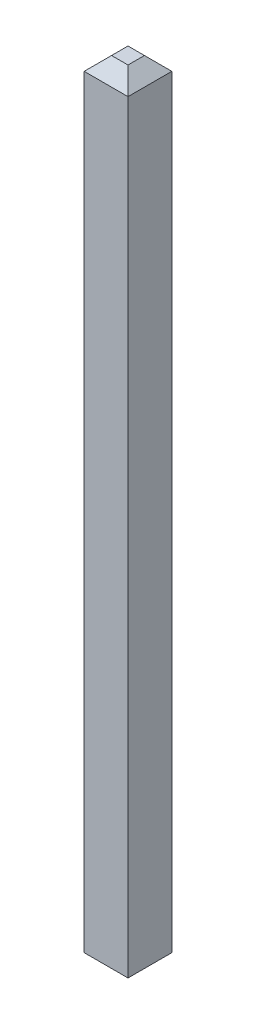
ISO-10303-21;
HEADER;
FILE_DESCRIPTION(('STEP AP214'),'2;1');
FILE_NAME('part.step','',(''),(''),'','','');
FILE_SCHEMA(('AUTOMOTIVE_DESIGN { 1 0 10303 214 1 1 1 1 }'));
ENDSEC;
DATA;
#1=APPLICATION_CONTEXT('core data for automotive mechanical design processes');
#2=APPLICATION_PROTOCOL_DEFINITION('international standard','automotive_design',2000,#1);
#3=PRODUCT_CONTEXT('',#1,'mechanical');
#4=PRODUCT('Part','Part','',(#3));
#5=PRODUCT_RELATED_PRODUCT_CATEGORY('part','',(#4));
#6=PRODUCT_DEFINITION_FORMATION('','',#4);
#7=PRODUCT_DEFINITION_CONTEXT('part definition',#1,'design');
#8=PRODUCT_DEFINITION('design','',#6,#7);
#9=PRODUCT_DEFINITION_SHAPE('','',#8);
#10=(LENGTH_UNIT() NAMED_UNIT(*) SI_UNIT(.MILLI.,.METRE.));
#11=(NAMED_UNIT(*) PLANE_ANGLE_UNIT() SI_UNIT($,.RADIAN.));
#12=(NAMED_UNIT(*) SI_UNIT($,.STERADIAN.) SOLID_ANGLE_UNIT());
#13=UNCERTAINTY_MEASURE_WITH_UNIT(LENGTH_MEASURE(1.E-05),#10,'distance_accuracy_value','');
#14=(GEOMETRIC_REPRESENTATION_CONTEXT(3) GLOBAL_UNCERTAINTY_ASSIGNED_CONTEXT((#13)) GLOBAL_UNIT_ASSIGNED_CONTEXT((#10,
#11,#12)) REPRESENTATION_CONTEXT('',''));
#15=CARTESIAN_POINT('',(0.,0.,0.));
#16=DIRECTION('',(0.,0.,1.));
#17=DIRECTION('',(1.,0.,0.));
#18=AXIS2_PLACEMENT_3D('',#15,#16,#17);
#19=CARTESIAN_POINT('',(9.21,7.07,-0.32));
#20=DIRECTION('',(-0.707106781186548,-0.707106781186548,0.));
#21=DIRECTION('',(-0.707106781186548,0.707106781186548,0.));
#22=AXIS2_PLACEMENT_3D('',#19,#20,#21);
#23=PLANE('',#22);
#24=DIRECTION('',(0.577350269189626,-0.577350269189626,0.577350269189626));
#25=VECTOR('',#24,1.);
#26=CARTESIAN_POINT('',(8.996666666667,7.283333333333,0.106666666667));
#27=LINE('',#26,#25);
#28=CARTESIAN_POINT('',(9.01,7.27,0.12));
#29=VERTEX_POINT('',#28);
#30=CARTESIAN_POINT('',(9.21,7.07,0.32));
#31=VERTEX_POINT('',#30);
#32=EDGE_CURVE('E113',#29,#31,#27,.T.);
#33=ORIENTED_EDGE('',*,*,#32,.T.);
#34=DIRECTION('',(0.,0.,1.));
#35=VECTOR('',#34,1.);
#36=CARTESIAN_POINT('',(9.21,7.07,-0.32));
#37=LINE('',#36,#35);
#38=CARTESIAN_POINT('',(9.21,7.07,-0.32));
#39=VERTEX_POINT('',#38);
#40=EDGE_CURVE('E111',#39,#31,#37,.T.);
#41=ORIENTED_EDGE('',*,*,#40,.F.);
#42=DIRECTION('',(0.577350269189626,-0.577350269189626,-0.577350269189626));
#43=VECTOR('',#42,1.);
#44=CARTESIAN_POINT('',(9.21,7.07,-0.32));
#45=LINE('',#44,#43);
#46=CARTESIAN_POINT('',(9.01,7.27,-0.12));
#47=VERTEX_POINT('',#46);
#48=EDGE_CURVE('E11',#47,#39,#45,.T.);
#49=ORIENTED_EDGE('',*,*,#48,.F.);
#50=DIRECTION('',(0.,0.,-1.));
#51=VECTOR('',#50,1.);
#52=CARTESIAN_POINT('',(9.01,7.27,-0.32));
#53=LINE('',#52,#51);
#54=EDGE_CURVE('E117',#29,#47,#53,.T.);
#55=ORIENTED_EDGE('',*,*,#54,.F.);
#56=EDGE_LOOP('',(#33,#41,#49,#55));
#57=FACE_BOUND('',#56,.T.);
#58=ADVANCED_FACE('F17',(#57),#23,.F.);
#59=CARTESIAN_POINT('',(8.89,7.07,-0.32));
#60=DIRECTION('',(0.,0.707106781186548,-0.707106781186548));
#61=DIRECTION('',(-1.,0.,0.));
#62=AXIS2_PLACEMENT_3D('',#59,#60,#61);
#63=PLANE('',#62);
#64=DIRECTION('',(0.577350269189626,0.577350269189626,0.577350269189626));
#65=VECTOR('',#64,1.);
#66=CARTESIAN_POINT('',(8.703333333333,7.203333333333,-0.186666666667));
#67=LINE('',#66,#65);
#68=CARTESIAN_POINT('',(8.57,7.07,-0.32));
#69=VERTEX_POINT('',#68);
#70=CARTESIAN_POINT('',(8.77,7.27,-0.12));
#71=VERTEX_POINT('',#70);
#72=EDGE_CURVE('E25',#69,#71,#67,.T.);
#73=ORIENTED_EDGE('',*,*,#72,.T.);
#74=DIRECTION('',(-1.,0.,0.));
#75=VECTOR('',#74,1.);
#76=CARTESIAN_POINT('',(8.57,7.27,-0.12));
#77=LINE('',#76,#75);
#78=EDGE_CURVE('E106',#47,#71,#77,.T.);
#79=ORIENTED_EDGE('',*,*,#78,.F.);
#80=ORIENTED_EDGE('',*,*,#48,.T.);
#81=DIRECTION('',(1.,0.,0.));
#82=VECTOR('',#81,1.);
#83=CARTESIAN_POINT('',(9.21,7.07,-0.32));
#84=LINE('',#83,#82);
#85=EDGE_CURVE('E103',#69,#39,#84,.T.);
#86=ORIENTED_EDGE('',*,*,#85,.F.);
#87=EDGE_LOOP('',(#73,#79,#80,#86));
#88=FACE_BOUND('',#87,.T.);
#89=ADVANCED_FACE('F101',(#88),#63,.T.);
#90=CARTESIAN_POINT('',(8.77,7.27,-0.32));
#91=DIRECTION('',(0.707106781186548,-0.707106781186548,0.));
#92=DIRECTION('',(0.,0.,-1.));
#93=AXIS2_PLACEMENT_3D('',#90,#91,#92);
#94=PLANE('',#93);
#95=DIRECTION('',(-0.577350269189626,-0.577350269189626,0.577350269189626));
#96=VECTOR('',#95,1.);
#97=CARTESIAN_POINT('',(8.703333333333,7.203333333333,0.186666666667));
#98=LINE('',#97,#96);
#99=CARTESIAN_POINT('',(8.77,7.27,0.12));
#100=VERTEX_POINT('',#99);
#101=CARTESIAN_POINT('',(8.57,7.07,0.32));
#102=VERTEX_POINT('',#101);
#103=EDGE_CURVE('E37',#100,#102,#98,.T.);
#104=ORIENTED_EDGE('',*,*,#103,.F.);
#105=DIRECTION('',(0.,0.,1.));
#106=VECTOR('',#105,1.);
#107=CARTESIAN_POINT('',(8.77,7.27,-0.32));
#108=LINE('',#107,#106);
#109=EDGE_CURVE('E169',#71,#100,#108,.T.);
#110=ORIENTED_EDGE('',*,*,#109,.F.);
#111=ORIENTED_EDGE('',*,*,#72,.F.);
#112=DIRECTION('',(0.,0.,-1.));
#113=VECTOR('',#112,1.);
#114=CARTESIAN_POINT('',(8.57,7.07,-0.32));
#115=LINE('',#114,#113);
#116=EDGE_CURVE('E144',#102,#69,#115,.T.);
#117=ORIENTED_EDGE('',*,*,#116,.F.);
#118=EDGE_LOOP('',(#104,#110,#111,#117));
#119=FACE_BOUND('',#118,.T.);
#120=ADVANCED_FACE('F330',(#119),#94,.F.);
#121=CARTESIAN_POINT('',(8.57,7.27,0.12));
#122=DIRECTION('',(0.,-0.707106781186548,-0.707106781186548));
#123=DIRECTION('',(0.,-0.707106781186548,0.707106781186548));
#124=AXIS2_PLACEMENT_3D('',#121,#122,#123);
#125=PLANE('',#124);
#126=ORIENTED_EDGE('',*,*,#32,.F.);
#127=DIRECTION('',(1.,0.,0.));
#128=VECTOR('',#127,1.);
#129=CARTESIAN_POINT('',(8.57,7.27,0.12));
#130=LINE('',#129,#128);
#131=EDGE_CURVE('E173',#100,#29,#130,.T.);
#132=ORIENTED_EDGE('',*,*,#131,.F.);
#133=ORIENTED_EDGE('',*,*,#103,.T.);
#134=DIRECTION('',(-1.,0.,0.));
#135=VECTOR('',#134,1.);
#136=CARTESIAN_POINT('',(8.89,7.07,0.32));
#137=LINE('',#136,#135);
#138=EDGE_CURVE('E118',#31,#102,#137,.T.);
#139=ORIENTED_EDGE('',*,*,#138,.F.);
#140=EDGE_LOOP('',(#126,#132,#133,#139));
#141=FACE_BOUND('',#140,.T.);
#142=ADVANCED_FACE('F335',(#141),#125,.F.);
#143=CARTESIAN_POINT('',(8.57,7.27,-0.32));
#144=DIRECTION('',(0.,-1.,0.));
#145=DIRECTION('',(0.,0.,-1.));
#146=AXIS2_PLACEMENT_3D('',#143,#144,#145);
#147=PLANE('',#146);
#148=ORIENTED_EDGE('',*,*,#54,.T.);
#149=ORIENTED_EDGE('',*,*,#78,.T.);
#150=ORIENTED_EDGE('',*,*,#109,.T.);
#151=ORIENTED_EDGE('',*,*,#131,.T.);
#152=EDGE_LOOP('',(#148,#149,#150,#151));
#153=FACE_BOUND('',#152,.T.);
#154=ADVANCED_FACE('F344',(#153),#147,.F.);
#155=CARTESIAN_POINT('',(9.21,7.27,-0.32));
#156=DIRECTION('',(-1.,0.,0.));
#157=DIRECTION('',(0.,1.,0.));
#158=AXIS2_PLACEMENT_3D('',#155,#156,#157);
#159=PLANE('',#158);
#160=DIRECTION('',(0.,-1.,0.));
#161=VECTOR('',#160,1.);
#162=CARTESIAN_POINT('',(9.21,7.27,-0.32));
#163=LINE('',#162,#161);
#164=CARTESIAN_POINT('',(9.21,-4.07,-0.32));
#165=VERTEX_POINT('',#164);
#166=EDGE_CURVE('E121',#39,#165,#163,.T.);
#167=ORIENTED_EDGE('',*,*,#166,.F.);
#168=ORIENTED_EDGE('',*,*,#40,.T.);
#169=DIRECTION('',(0.,-1.,0.));
#170=VECTOR('',#169,1.);
#171=CARTESIAN_POINT('',(9.21,7.27,0.32));
#172=LINE('',#171,#170);
#173=CARTESIAN_POINT('',(9.21,-4.07,0.32));
#174=VERTEX_POINT('',#173);
#175=EDGE_CURVE('E159',#31,#174,#172,.T.);
#176=ORIENTED_EDGE('',*,*,#175,.T.);
#177=DIRECTION('',(0.,0.,-1.));
#178=VECTOR('',#177,1.);
#179=CARTESIAN_POINT('',(9.21,-4.07,-0.32));
#180=LINE('',#179,#178);
#181=EDGE_CURVE('E124',#174,#165,#180,.T.);
#182=ORIENTED_EDGE('',*,*,#181,.T.);
#183=EDGE_LOOP('',(#167,#168,#176,#182));
#184=FACE_BOUND('',#183,.T.);
#185=ADVANCED_FACE('F122',(#184),#159,.F.);
#186=CARTESIAN_POINT('',(8.89,1.5,0.32));
#187=DIRECTION('',(0.,0.,-1.));
#188=DIRECTION('',(0.,-1.,0.));
#189=AXIS2_PLACEMENT_3D('',#186,#187,#188);
#190=PLANE('',#189);
#191=ORIENTED_EDGE('',*,*,#175,.F.);
#192=ORIENTED_EDGE('',*,*,#138,.T.);
#193=DIRECTION('',(0.,1.,0.));
#194=VECTOR('',#193,1.);
#195=CARTESIAN_POINT('',(8.57,-4.27,0.32));
#196=LINE('',#195,#194);
#197=CARTESIAN_POINT('',(8.57,-4.07,0.32));
#198=VERTEX_POINT('',#197);
#199=EDGE_CURVE('E129',#198,#102,#196,.T.);
#200=ORIENTED_EDGE('',*,*,#199,.F.);
#201=DIRECTION('',(1.,0.,0.));
#202=VECTOR('',#201,1.);
#203=CARTESIAN_POINT('',(8.89,-4.07,0.32));
#204=LINE('',#203,#202);
#205=EDGE_CURVE('E156',#198,#174,#204,.T.);
#206=ORIENTED_EDGE('',*,*,#205,.T.);
#207=EDGE_LOOP('',(#191,#192,#200,#206));
#208=FACE_BOUND('',#207,.T.);
#209=ADVANCED_FACE('F338',(#208),#190,.F.);
#210=CARTESIAN_POINT('',(9.01,-4.27,-0.32));
#211=DIRECTION('',(-0.707106781186548,0.707106781186548,0.));
#212=DIRECTION('',(0.,0.,1.));
#213=AXIS2_PLACEMENT_3D('',#210,#211,#212);
#214=PLANE('',#213);
#215=DIRECTION('',(-0.577350269189626,-0.577350269189626,0.577350269189626));
#216=VECTOR('',#215,1.);
#217=CARTESIAN_POINT('',(9.076666666667,-4.203333333333,-0.186666666667));
#218=LINE('',#217,#216);
#219=CARTESIAN_POINT('',(9.01,-4.27,-0.12));
#220=VERTEX_POINT('',#219);
#221=EDGE_CURVE('E140',#165,#220,#218,.T.);
#222=ORIENTED_EDGE('',*,*,#221,.F.);
#223=ORIENTED_EDGE('',*,*,#181,.F.);
#224=DIRECTION('',(-0.577350269189626,-0.577350269189626,-0.577350269189626));
#225=VECTOR('',#224,1.);
#226=CARTESIAN_POINT('',(8.863333333333,-4.416666666667,-0.02666666666667));
#227=LINE('',#226,#225);
#228=CARTESIAN_POINT('',(9.01,-4.27,0.12));
#229=VERTEX_POINT('',#228);
#230=EDGE_CURVE('E153',#174,#229,#227,.T.);
#231=ORIENTED_EDGE('',*,*,#230,.T.);
#232=DIRECTION('',(0.,0.,1.));
#233=VECTOR('',#232,1.);
#234=CARTESIAN_POINT('',(9.01,-4.27,-0.32));
#235=LINE('',#234,#233);
#236=EDGE_CURVE('E291',#220,#229,#235,.T.);
#237=ORIENTED_EDGE('',*,*,#236,.F.);
#238=EDGE_LOOP('',(#222,#223,#231,#237));
#239=FACE_BOUND('',#238,.T.);
#240=ADVANCED_FACE('F304',(#239),#214,.F.);
#241=CARTESIAN_POINT('',(9.21,-4.27,0.12));
#242=DIRECTION('',(0.,0.707106781186548,-0.707106781186548));
#243=DIRECTION('',(-1.,0.,0.));
#244=AXIS2_PLACEMENT_3D('',#241,#242,#243);
#245=PLANE('',#244);
#246=ORIENTED_EDGE('',*,*,#230,.F.);
#247=ORIENTED_EDGE('',*,*,#205,.F.);
#248=DIRECTION('',(-0.577350269189626,0.577350269189626,0.577350269189626));
#249=VECTOR('',#248,1.);
#250=CARTESIAN_POINT('',(8.783333333333,-4.283333333333,0.106666666667));
#251=LINE('',#250,#249);
#252=CARTESIAN_POINT('',(8.77,-4.27,0.12));
#253=VERTEX_POINT('',#252);
#254=EDGE_CURVE('E149',#253,#198,#251,.T.);
#255=ORIENTED_EDGE('',*,*,#254,.F.);
#256=DIRECTION('',(-1.,0.,0.));
#257=VECTOR('',#256,1.);
#258=CARTESIAN_POINT('',(9.21,-4.27,0.12));
#259=LINE('',#258,#257);
#260=EDGE_CURVE('E285',#229,#253,#259,.T.);
#261=ORIENTED_EDGE('',*,*,#260,.F.);
#262=EDGE_LOOP('',(#246,#247,#255,#261));
#263=FACE_BOUND('',#262,.T.);
#264=ADVANCED_FACE('F308',(#263),#245,.F.);
#265=CARTESIAN_POINT('',(8.57,-4.07,-0.32));
#266=DIRECTION('',(0.707106781186548,0.707106781186548,0.));
#267=DIRECTION('',(0.,0.,-1.));
#268=AXIS2_PLACEMENT_3D('',#265,#266,#267);
#269=PLANE('',#268);
#270=DIRECTION('',(0.577350269189626,-0.577350269189626,0.577350269189626));
#271=VECTOR('',#270,1.);
#272=CARTESIAN_POINT('',(8.676666666667,-4.176666666667,-0.213333333333));
#273=LINE('',#272,#271);
#274=CARTESIAN_POINT('',(8.57,-4.07,-0.32));
#275=VERTEX_POINT('',#274);
#276=CARTESIAN_POINT('',(8.77,-4.27,-0.12));
#277=VERTEX_POINT('',#276);
#278=EDGE_CURVE('E267',#275,#277,#273,.T.);
#279=ORIENTED_EDGE('',*,*,#278,.T.);
#280=DIRECTION('',(0.,0.,-1.));
#281=VECTOR('',#280,1.);
#282=CARTESIAN_POINT('',(8.77,-4.27,-0.32));
#283=LINE('',#282,#281);
#284=EDGE_CURVE('E279',#253,#277,#283,.T.);
#285=ORIENTED_EDGE('',*,*,#284,.F.);
#286=ORIENTED_EDGE('',*,*,#254,.T.);
#287=DIRECTION('',(0.,0.,1.));
#288=VECTOR('',#287,1.);
#289=CARTESIAN_POINT('',(8.57,-4.07,-0.32));
#290=LINE('',#289,#288);
#291=EDGE_CURVE('E148',#275,#198,#290,.T.);
#292=ORIENTED_EDGE('',*,*,#291,.F.);
#293=EDGE_LOOP('',(#279,#285,#286,#292));
#294=FACE_BOUND('',#293,.T.);
#295=ADVANCED_FACE('F311',(#294),#269,.F.);
#296=CARTESIAN_POINT('',(8.57,-4.27,-0.32));
#297=DIRECTION('',(1.,0.,0.));
#298=DIRECTION('',(0.,0.,1.));
#299=AXIS2_PLACEMENT_3D('',#296,#297,#298);
#300=PLANE('',#299);
#301=ORIENTED_EDGE('',*,*,#199,.T.);
#302=ORIENTED_EDGE('',*,*,#116,.T.);
#303=DIRECTION('',(0.,1.,0.));
#304=VECTOR('',#303,1.);
#305=CARTESIAN_POINT('',(8.57,-4.27,-0.32));
#306=LINE('',#305,#304);
#307=EDGE_CURVE('E133',#275,#69,#306,.T.);
#308=ORIENTED_EDGE('',*,*,#307,.F.);
#309=ORIENTED_EDGE('',*,*,#291,.T.);
#310=EDGE_LOOP('',(#301,#302,#308,#309));
#311=FACE_BOUND('',#310,.T.);
#312=ADVANCED_FACE('F323',(#311),#300,.F.);
#313=CARTESIAN_POINT('',(8.89,1.5,-0.32));
#314=DIRECTION('',(0.,0.,-1.));
#315=DIRECTION('',(0.,-1.,0.));
#316=AXIS2_PLACEMENT_3D('',#313,#314,#315);
#317=PLANE('',#316);
#318=ORIENTED_EDGE('',*,*,#307,.T.);
#319=ORIENTED_EDGE('',*,*,#85,.T.);
#320=ORIENTED_EDGE('',*,*,#166,.T.);
#321=DIRECTION('',(-1.,0.,0.));
#322=VECTOR('',#321,1.);
#323=CARTESIAN_POINT('',(8.57,-4.07,-0.32));
#324=LINE('',#323,#322);
#325=EDGE_CURVE('E261',#165,#275,#324,.T.);
#326=ORIENTED_EDGE('',*,*,#325,.T.);
#327=EDGE_LOOP('',(#318,#319,#320,#326));
#328=FACE_BOUND('',#327,.T.);
#329=ADVANCED_FACE('F131',(#328),#317,.T.);
#330=CARTESIAN_POINT('',(8.89,-4.07,-0.32));
#331=DIRECTION('',(0.,-0.707106781186548,-0.707106781186548));
#332=DIRECTION('',(0.,-0.707106781186548,0.707106781186548));
#333=AXIS2_PLACEMENT_3D('',#330,#331,#332);
#334=PLANE('',#333);
#335=ORIENTED_EDGE('',*,*,#278,.F.);
#336=ORIENTED_EDGE('',*,*,#325,.F.);
#337=ORIENTED_EDGE('',*,*,#221,.T.);
#338=DIRECTION('',(1.,0.,0.));
#339=VECTOR('',#338,1.);
#340=CARTESIAN_POINT('',(9.21,-4.27,-0.12));
#341=LINE('',#340,#339);
#342=EDGE_CURVE('E273',#277,#220,#341,.T.);
#343=ORIENTED_EDGE('',*,*,#342,.F.);
#344=EDGE_LOOP('',(#335,#336,#337,#343));
#345=FACE_BOUND('',#344,.T.);
#346=ADVANCED_FACE('F314',(#345),#334,.T.);
#347=CARTESIAN_POINT('',(9.21,-4.27,-0.32));
#348=DIRECTION('',(0.,1.,0.));
#349=DIRECTION('',(0.,0.,-1.));
#350=AXIS2_PLACEMENT_3D('',#347,#348,#349);
#351=PLANE('',#350);
#352=ORIENTED_EDGE('',*,*,#236,.T.);
#353=ORIENTED_EDGE('',*,*,#260,.T.);
#354=ORIENTED_EDGE('',*,*,#284,.T.);
#355=ORIENTED_EDGE('',*,*,#342,.T.);
#356=EDGE_LOOP('',(#352,#353,#354,#355));
#357=FACE_BOUND('',#356,.T.);
#358=ADVANCED_FACE('F300',(#357),#351,.F.);
#359=CLOSED_SHELL('',(#58,#89,#120,#142,#154,#185,#209,#240,#264,#295,#312,#329,#346,#358));
#360=MANIFOLD_SOLID_BREP('B1',#359);
#361=ADVANCED_BREP_SHAPE_REPRESENTATION('',(#18,#360),#14);
#362=SHAPE_DEFINITION_REPRESENTATION(#9,#361);
ENDSEC;
END-ISO-10303-21;
